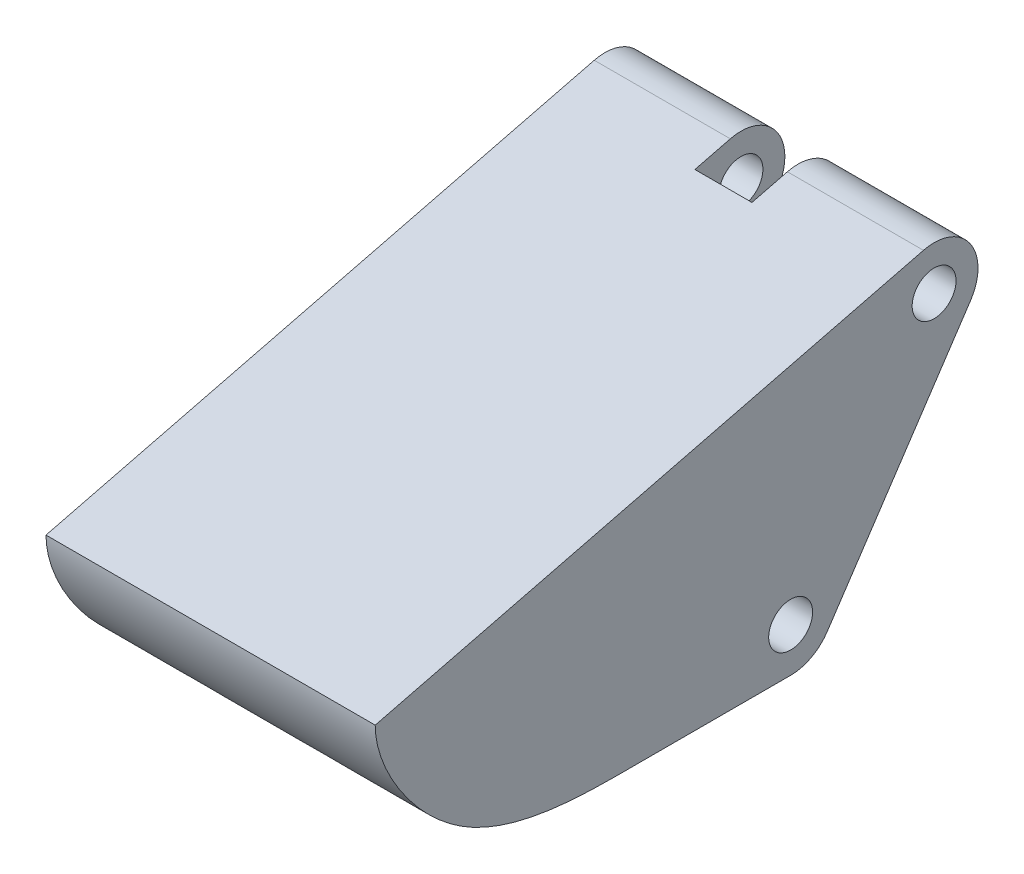
ISO-10303-21;
HEADER;
FILE_DESCRIPTION(('STEP AP214'),'2;1');
FILE_NAME('part.step','',(''),(''),'','','');
FILE_SCHEMA(('AUTOMOTIVE_DESIGN { 1 0 10303 214 1 1 1 1 }'));
ENDSEC;
DATA;
#1=APPLICATION_CONTEXT('core data for automotive mechanical design processes');
#2=APPLICATION_PROTOCOL_DEFINITION('international standard','automotive_design',2000,#1);
#3=PRODUCT_CONTEXT('',#1,'mechanical');
#4=PRODUCT('Part','Part','',(#3));
#5=PRODUCT_RELATED_PRODUCT_CATEGORY('part','',(#4));
#6=PRODUCT_DEFINITION_FORMATION('','',#4);
#7=PRODUCT_DEFINITION_CONTEXT('part definition',#1,'design');
#8=PRODUCT_DEFINITION('design','',#6,#7);
#9=PRODUCT_DEFINITION_SHAPE('','',#8);
#10=(LENGTH_UNIT() NAMED_UNIT(*) SI_UNIT(.MILLI.,.METRE.));
#11=(NAMED_UNIT(*) PLANE_ANGLE_UNIT() SI_UNIT($,.RADIAN.));
#12=(NAMED_UNIT(*) SI_UNIT($,.STERADIAN.) SOLID_ANGLE_UNIT());
#13=UNCERTAINTY_MEASURE_WITH_UNIT(LENGTH_MEASURE(1.E-05),#10,'distance_accuracy_value','');
#14=(GEOMETRIC_REPRESENTATION_CONTEXT(3) GLOBAL_UNCERTAINTY_ASSIGNED_CONTEXT((#13)) GLOBAL_UNIT_ASSIGNED_CONTEXT((#10,
#11,#12)) REPRESENTATION_CONTEXT('',''));
#15=CARTESIAN_POINT('',(0.,0.,0.));
#16=DIRECTION('',(0.,0.,1.));
#17=DIRECTION('',(1.,0.,0.));
#18=AXIS2_PLACEMENT_3D('',#15,#16,#17);
#19=CARTESIAN_POINT('',(7.5,-5.5,11.070367516976));
#20=DIRECTION('',(-1.,0.,0.));
#21=DIRECTION('',(0.,0.,1.));
#22=AXIS2_PLACEMENT_3D('',#19,#20,#21);
#23=CYLINDRICAL_SURFACE('',#22,2.);
#24=CARTESIAN_POINT('',(5.,-5.5,11.070367516976));
#25=DIRECTION('',(1.,0.,0.));
#26=DIRECTION('',(0.,0.,-1.));
#27=AXIS2_PLACEMENT_3D('',#24,#25,#26);
#28=CIRCLE('',#27,2.);
#29=CARTESIAN_POINT('',(5.,-6.60940039245046,9.4062669283003));
#30=VERTEX_POINT('',#29);
#31=CARTESIAN_POINT('',(5.,-7.5,11.070367516976));
#32=VERTEX_POINT('',#31);
#33=EDGE_CURVE('E122',#30,#32,#28,.F.);
#34=ORIENTED_EDGE('',*,*,#33,.F.);
#35=DIRECTION('',(-1.,0.,0.));
#36=VECTOR('',#35,1.);
#37=CARTESIAN_POINT('',(7.5,-6.60940039245046,9.4062669283003));
#38=LINE('',#37,#36);
#39=CARTESIAN_POINT('',(7.5,-6.60940039245046,9.4062669283003));
#40=VERTEX_POINT('',#39);
#41=EDGE_CURVE('E116',#40,#30,#38,.T.);
#42=ORIENTED_EDGE('',*,*,#41,.F.);
#43=CARTESIAN_POINT('',(7.5,-5.5,11.070367516976));
#44=DIRECTION('',(1.,0.,0.));
#45=DIRECTION('',(0.,0.,-1.));
#46=AXIS2_PLACEMENT_3D('',#43,#44,#45);
#47=CIRCLE('',#46,2.);
#48=CARTESIAN_POINT('',(7.5,-7.5,11.070367516976));
#49=VERTEX_POINT('',#48);
#50=EDGE_CURVE('E119',#40,#49,#47,.F.);
#51=ORIENTED_EDGE('',*,*,#50,.T.);
#52=DIRECTION('',(-1.,0.,0.));
#53=VECTOR('',#52,1.);
#54=CARTESIAN_POINT('',(7.5,-7.5,11.070367516976));
#55=LINE('',#54,#53);
#56=EDGE_CURVE('E176',#49,#32,#55,.T.);
#57=ORIENTED_EDGE('',*,*,#56,.T.);
#58=EDGE_LOOP('',(#34,#42,#51,#57));
#59=FACE_BOUND('',#58,.T.);
#60=ADVANCED_FACE('F43',(#59),#23,.T.);
#61=CARTESIAN_POINT('',(7.5,-5.5,11.070367516976));
#62=DIRECTION('',(-1.,0.,0.));
#63=DIRECTION('',(0.,0.,1.));
#64=AXIS2_PLACEMENT_3D('',#61,#62,#63);
#65=CYLINDRICAL_SURFACE('',#64,1.);
#66=CARTESIAN_POINT('',(5.,-5.5,11.070367516976));
#67=DIRECTION('',(1.,0.,0.));
#68=DIRECTION('',(0.,0.,-1.));
#69=AXIS2_PLACEMENT_3D('',#66,#67,#68);
#70=CIRCLE('',#69,1.);
#71=CARTESIAN_POINT('',(5.,-5.5,10.070367516976));
#72=VERTEX_POINT('',#71);
#73=EDGE_CURVE('E195',#72,#72,#70,.T.);
#74=ORIENTED_EDGE('',*,*,#73,.F.);
#75=EDGE_LOOP('',(#74));
#76=FACE_BOUND('',#75,.T.);
#77=CARTESIAN_POINT('',(7.5,-5.5,11.070367516976));
#78=DIRECTION('',(1.,0.,0.));
#79=DIRECTION('',(0.,0.,-1.));
#80=AXIS2_PLACEMENT_3D('',#77,#78,#79);
#81=CIRCLE('',#80,1.);
#82=CARTESIAN_POINT('',(7.5,-5.5,10.070367516976));
#83=VERTEX_POINT('',#82);
#84=EDGE_CURVE('E241',#83,#83,#81,.T.);
#85=ORIENTED_EDGE('',*,*,#84,.T.);
#86=EDGE_LOOP('',(#85));
#87=FACE_BOUND('',#86,.T.);
#88=ADVANCED_FACE('F265',(#76,#87),#65,.F.);
#89=CARTESIAN_POINT('',(7.5,4.3050263695366,4.53368327061825));
#90=DIRECTION('',(-1.,0.,0.));
#91=DIRECTION('',(0.,0.,1.));
#92=AXIS2_PLACEMENT_3D('',#89,#90,#91);
#93=CYLINDRICAL_SURFACE('',#92,1.);
#94=CARTESIAN_POINT('',(-1.3,4.3050263695366,4.53368327061825));
#95=DIRECTION('',(-1.,0.,0.));
#96=DIRECTION('',(0.,0.,1.));
#97=AXIS2_PLACEMENT_3D('',#94,#95,#96);
#98=CIRCLE('',#97,1.);
#99=CARTESIAN_POINT('',(-1.3,4.3050263695366,5.53368327061825));
#100=VERTEX_POINT('',#99);
#101=EDGE_CURVE('E234',#100,#100,#98,.T.);
#102=ORIENTED_EDGE('',*,*,#101,.F.);
#103=EDGE_LOOP('',(#102));
#104=FACE_BOUND('',#103,.T.);
#105=CARTESIAN_POINT('',(-7.5,4.3050263695366,4.53368327061825));
#106=DIRECTION('',(1.,0.,0.));
#107=DIRECTION('',(0.,0.,-1.));
#108=AXIS2_PLACEMENT_3D('',#105,#106,#107);
#109=CIRCLE('',#108,1.);
#110=CARTESIAN_POINT('',(-7.5,4.3050263695366,3.53368327061825));
#111=VERTEX_POINT('',#110);
#112=EDGE_CURVE('E143',#111,#111,#109,.T.);
#113=ORIENTED_EDGE('',*,*,#112,.F.);
#114=EDGE_LOOP('',(#113));
#115=FACE_BOUND('',#114,.T.);
#116=ADVANCED_FACE('F273',(#104,#115),#93,.F.);
#117=CARTESIAN_POINT('',(7.5,4.3050263695366,4.53368327061825));
#118=DIRECTION('',(-1.,0.,0.));
#119=DIRECTION('',(0.,0.,1.));
#120=AXIS2_PLACEMENT_3D('',#117,#118,#119);
#121=CYLINDRICAL_SURFACE('',#120,2.);
#122=CARTESIAN_POINT('',(-1.3,4.3050263695366,4.53368327061825));
#123=DIRECTION('',(-1.,0.,0.));
#124=DIRECTION('',(0.,0.,1.));
#125=AXIS2_PLACEMENT_3D('',#122,#123,#124);
#126=CIRCLE('',#125,2.);
#127=CARTESIAN_POINT('',(-1.3,6.24531136982727,5.01875452069092));
#128=VERTEX_POINT('',#127);
#129=CARTESIAN_POINT('',(-1.3,3.19562597708615,2.86958268194257));
#130=VERTEX_POINT('',#129);
#131=EDGE_CURVE('E186',#128,#130,#126,.T.);
#132=ORIENTED_EDGE('',*,*,#131,.T.);
#133=DIRECTION('',(-1.,0.,0.));
#134=VECTOR('',#133,1.);
#135=CARTESIAN_POINT('',(7.5,3.19562597708615,2.86958268194257));
#136=LINE('',#135,#134);
#137=CARTESIAN_POINT('',(-7.5,3.19562597708615,2.86958268194257));
#138=VERTEX_POINT('',#137);
#139=EDGE_CURVE('E174',#130,#138,#136,.T.);
#140=ORIENTED_EDGE('',*,*,#139,.T.);
#141=CARTESIAN_POINT('',(-7.5,4.3050263695366,4.53368327061825));
#142=DIRECTION('',(1.,0.,0.));
#143=DIRECTION('',(0.,0.,-1.));
#144=AXIS2_PLACEMENT_3D('',#141,#142,#143);
#145=CIRCLE('',#144,2.);
#146=CARTESIAN_POINT('',(-7.5,6.24531136982727,5.01875452069092));
#147=VERTEX_POINT('',#146);
#148=EDGE_CURVE('E168',#138,#147,#145,.T.);
#149=ORIENTED_EDGE('',*,*,#148,.T.);
#150=DIRECTION('',(-1.,0.,0.));
#151=VECTOR('',#150,1.);
#152=CARTESIAN_POINT('',(7.5,6.24531136982727,5.01875452069092));
#153=LINE('',#152,#151);
#154=EDGE_CURVE('E95',#128,#147,#153,.T.);
#155=ORIENTED_EDGE('',*,*,#154,.F.);
#156=EDGE_LOOP('',(#132,#140,#149,#155));
#157=FACE_BOUND('',#156,.T.);
#158=ADVANCED_FACE('F261',(#157),#121,.T.);
#159=CARTESIAN_POINT('',(7.5,7.05882352941176,1.76470588235294));
#160=DIRECTION('',(0.,-0.970142500145332,-0.242535625036333));
#161=DIRECTION('',(0.,0.242535625036333,-0.970142500145332));
#162=AXIS2_PLACEMENT_3D('',#159,#160,#161);
#163=PLANE('',#162);
#164=DIRECTION('',(-1.,0.,0.));
#165=VECTOR('',#164,1.);
#166=CARTESIAN_POINT('',(7.5,5.84157918234543,6.63368327061825));
#167=LINE('',#166,#165);
#168=CARTESIAN_POINT('',(1.3,5.84157918234543,6.63368327061825));
#169=VERTEX_POINT('',#168);
#170=CARTESIAN_POINT('',(-1.3,5.84157918234543,6.63368327061825));
#171=VERTEX_POINT('',#170);
#172=EDGE_CURVE('E147',#169,#171,#167,.T.);
#173=ORIENTED_EDGE('',*,*,#172,.T.);
#174=DIRECTION('',(0.,0.242535625036333,-0.970142500145332));
#175=VECTOR('',#174,1.);
#176=CARTESIAN_POINT('',(-1.3,7.05882352941176,1.76470588235294));
#177=LINE('',#176,#175);
#178=EDGE_CURVE('E229',#171,#128,#177,.T.);
#179=ORIENTED_EDGE('',*,*,#178,.T.);
#180=ORIENTED_EDGE('',*,*,#154,.T.);
#181=DIRECTION('',(0.,-0.242535625036333,0.970142500145332));
#182=VECTOR('',#181,1.);
#183=CARTESIAN_POINT('',(-7.5,7.05882352941176,1.76470588235294));
#184=LINE('',#183,#182);
#185=CARTESIAN_POINT('',(-7.5,0.,30.));
#186=VERTEX_POINT('',#185);
#187=EDGE_CURVE('E150',#147,#186,#184,.T.);
#188=ORIENTED_EDGE('',*,*,#187,.T.);
#189=DIRECTION('',(-1.,0.,0.));
#190=VECTOR('',#189,1.);
#191=CARTESIAN_POINT('',(7.5,0.,30.));
#192=LINE('',#191,#190);
#193=CARTESIAN_POINT('',(7.5,0.,30.));
#194=VERTEX_POINT('',#193);
#195=EDGE_CURVE('E181',#194,#186,#192,.T.);
#196=ORIENTED_EDGE('',*,*,#195,.F.);
#197=DIRECTION('',(0.,-0.242535625036333,0.970142500145332));
#198=VECTOR('',#197,1.);
#199=CARTESIAN_POINT('',(7.5,7.05882352941176,1.76470588235294));
#200=LINE('',#199,#198);
#201=CARTESIAN_POINT('',(7.5,6.24531136982727,5.01875452069092));
#202=VERTEX_POINT('',#201);
#203=EDGE_CURVE('E244',#202,#194,#200,.T.);
#204=ORIENTED_EDGE('',*,*,#203,.F.);
#205=CARTESIAN_POINT('',(1.3,6.24531136982727,5.01875452069092));
#206=VERTEX_POINT('',#205);
#207=EDGE_CURVE('E171',#202,#206,#153,.T.);
#208=ORIENTED_EDGE('',*,*,#207,.T.);
#209=DIRECTION('',(0.,-0.242535625036333,0.970142500145332));
#210=VECTOR('',#209,1.);
#211=CARTESIAN_POINT('',(1.3,7.05882352941176,1.76470588235294));
#212=LINE('',#211,#210);
#213=EDGE_CURVE('E223',#206,#169,#212,.T.);
#214=ORIENTED_EDGE('',*,*,#213,.T.);
#215=EDGE_LOOP('',(#173,#179,#180,#188,#196,#204,#208,#214));
#216=FACE_BOUND('',#215,.T.);
#217=ADVANCED_FACE('F258',(#216),#163,.F.);
#218=CARTESIAN_POINT('',(7.5,0.,30.));
#219=CARTESIAN_POINT('',(7.5,-1.86201061413692,30.));
#220=CARTESIAN_POINT('',(7.5,-7.67088107731904,26.2969055526664));
#221=CARTESIAN_POINT('',(7.5,-7.5,20.233591890825));
#222=CARTESIAN_POINT('',(7.5,-7.5,18.));
#223=B_SPLINE_CURVE_WITH_KNOTS('',3,(#218,#219,#220,#221,#222),.UNSPECIFIED.,.F.,.F.,(4,1,4),
(0.,0.469762972864334,1.),.UNSPECIFIED.);
#224=DIRECTION('',(-1.,0.,0.));
#225=VECTOR('',#224,1.);
#226=SURFACE_OF_LINEAR_EXTRUSION('',#223,#225);
#227=CARTESIAN_POINT('',(-7.5,0.,30.));
#228=CARTESIAN_POINT('',(-7.5,-1.86201061413692,30.));
#229=CARTESIAN_POINT('',(-7.5,-7.67088107731904,26.2969055526664));
#230=CARTESIAN_POINT('',(-7.5,-7.5,20.233591890825));
#231=CARTESIAN_POINT('',(-7.5,-7.5,18.));
#232=B_SPLINE_CURVE_WITH_KNOTS('',3,(#227,#228,#229,#230,#231),.UNSPECIFIED.,.F.,.F.,(4,1,4),
(0.,0.469762972864334,1.),.UNSPECIFIED.);
#233=CARTESIAN_POINT('',(-7.5,-7.5,18.));
#234=VERTEX_POINT('',#233);
#235=EDGE_CURVE('E152',#186,#234,#232,.T.);
#236=ORIENTED_EDGE('',*,*,#235,.T.);
#237=DIRECTION('',(-1.,0.,0.));
#238=VECTOR('',#237,1.);
#239=CARTESIAN_POINT('',(7.5,-7.5,18.));
#240=LINE('',#239,#238);
#241=CARTESIAN_POINT('',(7.5,-7.5,18.));
#242=VERTEX_POINT('',#241);
#243=EDGE_CURVE('E178',#242,#234,#240,.T.);
#244=ORIENTED_EDGE('',*,*,#243,.F.);
#245=EDGE_CURVE('E104',#194,#242,#223,.T.);
#246=ORIENTED_EDGE('',*,*,#245,.F.);
#247=ORIENTED_EDGE('',*,*,#195,.T.);
#248=EDGE_LOOP('',(#236,#244,#246,#247));
#249=FACE_BOUND('',#248,.T.);
#250=ADVANCED_FACE('F253',(#249),#226,.F.);
#251=CARTESIAN_POINT('',(7.5,-7.5,0.));
#252=DIRECTION('',(0.,1.,0.));
#253=DIRECTION('',(0.,0.,1.));
#254=AXIS2_PLACEMENT_3D('',#251,#252,#253);
#255=PLANE('',#254);
#256=CARTESIAN_POINT('',(0.,-7.5,10.7537427266206));
#257=DIRECTION('',(0.,-1.,0.));
#258=DIRECTION('',(0.,0.,1.));
#259=AXIS2_PLACEMENT_3D('',#256,#257,#258);
#260=CIRCLE('',#259,6.);
#261=CARTESIAN_POINT('',(5.,-7.5,14.070367516976));
#262=VERTEX_POINT('',#261);
#263=CARTESIAN_POINT('',(-5.,-7.5,14.070367516976));
#264=VERTEX_POINT('',#263);
#265=EDGE_CURVE('E336',#262,#264,#260,.T.);
#266=ORIENTED_EDGE('',*,*,#265,.F.);
#267=DIRECTION('',(0.,0.,1.));
#268=VECTOR('',#267,1.);
#269=CARTESIAN_POINT('',(5.,-7.5,7.07036751697599));
#270=LINE('',#269,#268);
#271=EDGE_CURVE('E330',#32,#262,#270,.T.);
#272=ORIENTED_EDGE('',*,*,#271,.F.);
#273=ORIENTED_EDGE('',*,*,#56,.F.);
#274=DIRECTION('',(0.,0.,-1.));
#275=VECTOR('',#274,1.);
#276=CARTESIAN_POINT('',(7.5,-7.5,0.));
#277=LINE('',#276,#275);
#278=EDGE_CURVE('E132',#242,#49,#277,.T.);
#279=ORIENTED_EDGE('',*,*,#278,.F.);
#280=ORIENTED_EDGE('',*,*,#243,.T.);
#281=DIRECTION('',(0.,0.,-1.));
#282=VECTOR('',#281,1.);
#283=CARTESIAN_POINT('',(-7.5,-7.5,0.));
#284=LINE('',#283,#282);
#285=CARTESIAN_POINT('',(-7.5,-7.5,11.070367516976));
#286=VERTEX_POINT('',#285);
#287=EDGE_CURVE('E156',#234,#286,#284,.T.);
#288=ORIENTED_EDGE('',*,*,#287,.T.);
#289=CARTESIAN_POINT('',(-5.,-7.5,11.070367516976));
#290=VERTEX_POINT('',#289);
#291=EDGE_CURVE('E126',#290,#286,#55,.T.);
#292=ORIENTED_EDGE('',*,*,#291,.F.);
#293=DIRECTION('',(0.,0.,-1.));
#294=VECTOR('',#293,1.);
#295=CARTESIAN_POINT('',(-5.,-7.5,7.07036751697599));
#296=LINE('',#295,#294);
#297=EDGE_CURVE('E299',#264,#290,#296,.T.);
#298=ORIENTED_EDGE('',*,*,#297,.F.);
#299=EDGE_LOOP('',(#266,#272,#273,#279,#280,#288,#292,#298));
#300=FACE_BOUND('',#299,.T.);
#301=ADVANCED_FACE('F257',(#300),#255,.F.);
#302=CARTESIAN_POINT('',(-5.,-5.5,11.070367516976));
#303=DIRECTION('',(-1.,0.,0.));
#304=DIRECTION('',(0.,0.,1.));
#305=AXIS2_PLACEMENT_3D('',#302,#303,#304);
#306=CIRCLE('',#305,2.);
#307=CARTESIAN_POINT('',(-5.,-6.60940039245046,9.4062669283003));
#308=VERTEX_POINT('',#307);
#309=EDGE_CURVE('E198',#290,#308,#306,.F.);
#310=ORIENTED_EDGE('',*,*,#309,.F.);
#311=ORIENTED_EDGE('',*,*,#291,.T.);
#312=CARTESIAN_POINT('',(-7.5,-5.5,11.070367516976));
#313=DIRECTION('',(1.,0.,0.));
#314=DIRECTION('',(0.,0.,-1.));
#315=AXIS2_PLACEMENT_3D('',#312,#313,#314);
#316=CIRCLE('',#315,2.);
#317=CARTESIAN_POINT('',(-7.5,-6.60940039245046,9.4062669283003));
#318=VERTEX_POINT('',#317);
#319=EDGE_CURVE('E162',#318,#286,#316,.F.);
#320=ORIENTED_EDGE('',*,*,#319,.F.);
#321=EDGE_CURVE('E127',#308,#318,#38,.T.);
#322=ORIENTED_EDGE('',*,*,#321,.F.);
#323=EDGE_LOOP('',(#310,#311,#320,#322));
#324=FACE_BOUND('',#323,.T.);
#325=ADVANCED_FACE('F274',(#324),#23,.T.);
#326=CARTESIAN_POINT('',(7.5,2.30769230769231,3.46153846153846));
#327=DIRECTION('',(0.,-0.554700196225229,-0.832050294337844));
#328=DIRECTION('',(0.,0.832050294337844,-0.554700196225229));
#329=AXIS2_PLACEMENT_3D('',#326,#327,#328);
#330=PLANE('',#329);
#331=DIRECTION('',(0.,-0.832050294337844,0.554700196225229));
#332=VECTOR('',#331,1.);
#333=CARTESIAN_POINT('',(5.,2.30769230769231,3.46153846153846));
#334=LINE('',#333,#332);
#335=CARTESIAN_POINT('',(5.,-3.5,7.33333333333333));
#336=VERTEX_POINT('',#335);
#337=EDGE_CURVE('E197',#336,#30,#334,.T.);
#338=ORIENTED_EDGE('',*,*,#337,.F.);
#339=DIRECTION('',(1.,0.,0.));
#340=VECTOR('',#339,1.);
#341=CARTESIAN_POINT('',(7.5,-3.5,7.33333333333333));
#342=LINE('',#341,#340);
#343=CARTESIAN_POINT('',(-5.,-3.5,7.33333333333333));
#344=VERTEX_POINT('',#343);
#345=EDGE_CURVE('E11',#344,#336,#342,.T.);
#346=ORIENTED_EDGE('',*,*,#345,.F.);
#347=DIRECTION('',(0.,0.832050294337844,-0.554700196225229));
#348=VECTOR('',#347,1.);
#349=CARTESIAN_POINT('',(-5.,2.30769230769231,3.46153846153846));
#350=LINE('',#349,#348);
#351=EDGE_CURVE('E193',#308,#344,#350,.T.);
#352=ORIENTED_EDGE('',*,*,#351,.F.);
#353=ORIENTED_EDGE('',*,*,#321,.T.);
#354=DIRECTION('',(0.,-0.832050294337844,0.554700196225229));
#355=VECTOR('',#354,1.);
#356=CARTESIAN_POINT('',(-7.5,2.30769230769231,3.46153846153846));
#357=LINE('',#356,#355);
#358=EDGE_CURVE('E165',#138,#318,#357,.T.);
#359=ORIENTED_EDGE('',*,*,#358,.F.);
#360=ORIENTED_EDGE('',*,*,#139,.F.);
#361=DIRECTION('',(0.,0.832050294337844,-0.554700196225229));
#362=VECTOR('',#361,1.);
#363=CARTESIAN_POINT('',(-1.3,2.30769230769231,3.46153846153846));
#364=LINE('',#363,#362);
#365=CARTESIAN_POINT('',(-1.3,-2.45052490592739,6.63368327061825));
#366=VERTEX_POINT('',#365);
#367=EDGE_CURVE('E231',#366,#130,#364,.T.);
#368=ORIENTED_EDGE('',*,*,#367,.F.);
#369=DIRECTION('',(-1.,0.,0.));
#370=VECTOR('',#369,1.);
#371=CARTESIAN_POINT('',(7.5,-2.45052490592739,6.63368327061825));
#372=LINE('',#371,#370);
#373=CARTESIAN_POINT('',(1.3,-2.45052490592739,6.63368327061825));
#374=VERTEX_POINT('',#373);
#375=EDGE_CURVE('E51',#374,#366,#372,.T.);
#376=ORIENTED_EDGE('',*,*,#375,.F.);
#377=DIRECTION('',(0.,-0.832050294337844,0.554700196225229));
#378=VECTOR('',#377,1.);
#379=CARTESIAN_POINT('',(1.3,2.30769230769231,3.46153846153846));
#380=LINE('',#379,#378);
#381=CARTESIAN_POINT('',(1.3,3.19562597708615,2.86958268194257));
#382=VERTEX_POINT('',#381);
#383=EDGE_CURVE('E218',#382,#374,#380,.T.);
#384=ORIENTED_EDGE('',*,*,#383,.F.);
#385=CARTESIAN_POINT('',(7.5,3.19562597708615,2.86958268194257));
#386=VERTEX_POINT('',#385);
#387=EDGE_CURVE('E138',#386,#382,#136,.T.);
#388=ORIENTED_EDGE('',*,*,#387,.F.);
#389=DIRECTION('',(0.,-0.832050294337844,0.554700196225229));
#390=VECTOR('',#389,1.);
#391=CARTESIAN_POINT('',(7.5,2.30769230769231,3.46153846153846));
#392=LINE('',#391,#390);
#393=EDGE_CURVE('E130',#386,#40,#392,.T.);
#394=ORIENTED_EDGE('',*,*,#393,.T.);
#395=ORIENTED_EDGE('',*,*,#41,.T.);
#396=EDGE_LOOP('',(#338,#346,#352,#353,#359,#360,#368,#376,#384,#388,#394,#395));
#397=FACE_BOUND('',#396,.T.);
#398=ADVANCED_FACE('F135',(#397),#330,.T.);
#399=CARTESIAN_POINT('',(-5.,-5.5,11.070367516976));
#400=DIRECTION('',(-1.,0.,0.));
#401=DIRECTION('',(0.,0.,1.));
#402=AXIS2_PLACEMENT_3D('',#399,#400,#401);
#403=CIRCLE('',#402,1.);
#404=CARTESIAN_POINT('',(-5.,-5.5,12.070367516976));
#405=VERTEX_POINT('',#404);
#406=EDGE_CURVE('E191',#405,#405,#403,.T.);
#407=ORIENTED_EDGE('',*,*,#406,.F.);
#408=EDGE_LOOP('',(#407));
#409=FACE_BOUND('',#408,.T.);
#410=CARTESIAN_POINT('',(-7.5,-5.5,11.070367516976));
#411=DIRECTION('',(1.,0.,0.));
#412=DIRECTION('',(0.,0.,-1.));
#413=AXIS2_PLACEMENT_3D('',#410,#411,#412);
#414=CIRCLE('',#413,1.);
#415=CARTESIAN_POINT('',(-7.5,-5.5,10.070367516976));
#416=VERTEX_POINT('',#415);
#417=EDGE_CURVE('E146',#416,#416,#414,.T.);
#418=ORIENTED_EDGE('',*,*,#417,.F.);
#419=EDGE_LOOP('',(#418));
#420=FACE_BOUND('',#419,.T.);
#421=ADVANCED_FACE('F262',(#409,#420),#65,.F.);
#422=CARTESIAN_POINT('',(1.3,4.3050263695366,4.53368327061825));
#423=DIRECTION('',(1.,0.,0.));
#424=DIRECTION('',(0.,0.,-1.));
#425=AXIS2_PLACEMENT_3D('',#422,#423,#424);
#426=CIRCLE('',#425,1.);
#427=CARTESIAN_POINT('',(1.3,4.3050263695366,3.53368327061825));
#428=VERTEX_POINT('',#427);
#429=EDGE_CURVE('E226',#428,#428,#426,.T.);
#430=ORIENTED_EDGE('',*,*,#429,.F.);
#431=EDGE_LOOP('',(#430));
#432=FACE_BOUND('',#431,.T.);
#433=CARTESIAN_POINT('',(7.5,4.3050263695366,4.53368327061825));
#434=DIRECTION('',(1.,0.,0.));
#435=DIRECTION('',(0.,0.,-1.));
#436=AXIS2_PLACEMENT_3D('',#433,#434,#435);
#437=CIRCLE('',#436,1.);
#438=CARTESIAN_POINT('',(7.5,4.3050263695366,3.53368327061825));
#439=VERTEX_POINT('',#438);
#440=EDGE_CURVE('E170',#439,#439,#437,.T.);
#441=ORIENTED_EDGE('',*,*,#440,.T.);
#442=EDGE_LOOP('',(#441));
#443=FACE_BOUND('',#442,.T.);
#444=ADVANCED_FACE('F45',(#432,#443),#93,.F.);
#445=ORIENTED_EDGE('',*,*,#387,.T.);
#446=CARTESIAN_POINT('',(1.3,4.3050263695366,4.53368327061825));
#447=DIRECTION('',(1.,0.,0.));
#448=DIRECTION('',(0.,0.,-1.));
#449=AXIS2_PLACEMENT_3D('',#446,#447,#448);
#450=CIRCLE('',#449,2.);
#451=EDGE_CURVE('E183',#382,#206,#450,.T.);
#452=ORIENTED_EDGE('',*,*,#451,.T.);
#453=ORIENTED_EDGE('',*,*,#207,.F.);
#454=CARTESIAN_POINT('',(7.5,4.3050263695366,4.53368327061825));
#455=DIRECTION('',(1.,0.,0.));
#456=DIRECTION('',(0.,0.,-1.));
#457=AXIS2_PLACEMENT_3D('',#454,#455,#456);
#458=CIRCLE('',#457,2.);
#459=EDGE_CURVE('E66',#386,#202,#458,.T.);
#460=ORIENTED_EDGE('',*,*,#459,.F.);
#461=EDGE_LOOP('',(#445,#452,#453,#460));
#462=FACE_BOUND('',#461,.T.);
#463=ADVANCED_FACE('F271',(#462),#121,.T.);
#464=CARTESIAN_POINT('',(7.5,0.,0.));
#465=DIRECTION('',(1.,0.,0.));
#466=DIRECTION('',(0.,0.,-1.));
#467=AXIS2_PLACEMENT_3D('',#464,#465,#466);
#468=PLANE('',#467);
#469=ORIENTED_EDGE('',*,*,#440,.F.);
#470=EDGE_LOOP('',(#469));
#471=FACE_BOUND('',#470,.T.);
#472=ORIENTED_EDGE('',*,*,#84,.F.);
#473=EDGE_LOOP('',(#472));
#474=FACE_BOUND('',#473,.T.);
#475=ORIENTED_EDGE('',*,*,#203,.T.);
#476=ORIENTED_EDGE('',*,*,#245,.T.);
#477=ORIENTED_EDGE('',*,*,#278,.T.);
#478=ORIENTED_EDGE('',*,*,#50,.F.);
#479=ORIENTED_EDGE('',*,*,#393,.F.);
#480=ORIENTED_EDGE('',*,*,#459,.T.);
#481=EDGE_LOOP('',(#475,#476,#477,#478,#479,#480));
#482=FACE_BOUND('',#481,.T.);
#483=ADVANCED_FACE('F129',(#471,#474,#482),#468,.T.);
#484=CARTESIAN_POINT('',(-7.5,0.,0.));
#485=DIRECTION('',(1.,0.,0.));
#486=DIRECTION('',(0.,0.,-1.));
#487=AXIS2_PLACEMENT_3D('',#484,#485,#486);
#488=PLANE('',#487);
#489=ORIENTED_EDGE('',*,*,#112,.T.);
#490=EDGE_LOOP('',(#489));
#491=FACE_BOUND('',#490,.T.);
#492=ORIENTED_EDGE('',*,*,#417,.T.);
#493=EDGE_LOOP('',(#492));
#494=FACE_BOUND('',#493,.T.);
#495=ORIENTED_EDGE('',*,*,#187,.F.);
#496=ORIENTED_EDGE('',*,*,#148,.F.);
#497=ORIENTED_EDGE('',*,*,#358,.T.);
#498=ORIENTED_EDGE('',*,*,#319,.T.);
#499=ORIENTED_EDGE('',*,*,#287,.F.);
#500=ORIENTED_EDGE('',*,*,#235,.F.);
#501=EDGE_LOOP('',(#495,#496,#497,#498,#499,#500));
#502=FACE_BOUND('',#501,.T.);
#503=ADVANCED_FACE('F303',(#491,#494,#502),#488,.F.);
#504=CARTESIAN_POINT('',(1.3,-8.69497363046339,6.63368327061825));
#505=DIRECTION('',(0.,0.,1.));
#506=DIRECTION('',(1.,0.,0.));
#507=AXIS2_PLACEMENT_3D('',#504,#505,#506);
#508=PLANE('',#507);
#509=DIRECTION('',(0.,1.,0.));
#510=VECTOR('',#509,1.);
#511=CARTESIAN_POINT('',(1.3,-8.69497363046339,6.63368327061825));
#512=LINE('',#511,#510);
#513=EDGE_CURVE('E215',#374,#169,#512,.T.);
#514=ORIENTED_EDGE('',*,*,#513,.F.);
#515=ORIENTED_EDGE('',*,*,#375,.T.);
#516=DIRECTION('',(0.,1.,0.));
#517=VECTOR('',#516,1.);
#518=CARTESIAN_POINT('',(-1.3,-8.69497363046339,6.63368327061825));
#519=LINE('',#518,#517);
#520=EDGE_CURVE('E214',#366,#171,#519,.T.);
#521=ORIENTED_EDGE('',*,*,#520,.T.);
#522=ORIENTED_EDGE('',*,*,#172,.F.);
#523=EDGE_LOOP('',(#514,#515,#521,#522));
#524=FACE_BOUND('',#523,.T.);
#525=ADVANCED_FACE('F373',(#524),#508,.F.);
#526=CARTESIAN_POINT('',(-1.3,-8.69497363046339,6.63368327061825));
#527=DIRECTION('',(-1.,0.,0.));
#528=DIRECTION('',(0.,0.,1.));
#529=AXIS2_PLACEMENT_3D('',#526,#527,#528);
#530=PLANE('',#529);
#531=ORIENTED_EDGE('',*,*,#101,.T.);
#532=EDGE_LOOP('',(#531));
#533=FACE_BOUND('',#532,.T.);
#534=ORIENTED_EDGE('',*,*,#367,.T.);
#535=ORIENTED_EDGE('',*,*,#131,.F.);
#536=ORIENTED_EDGE('',*,*,#178,.F.);
#537=ORIENTED_EDGE('',*,*,#520,.F.);
#538=EDGE_LOOP('',(#534,#535,#536,#537));
#539=FACE_BOUND('',#538,.T.);
#540=ADVANCED_FACE('F369',(#533,#539),#530,.F.);
#541=CARTESIAN_POINT('',(1.3,-8.69497363046339,6.63368327061825));
#542=DIRECTION('',(1.,0.,0.));
#543=DIRECTION('',(0.,0.,-1.));
#544=AXIS2_PLACEMENT_3D('',#541,#542,#543);
#545=PLANE('',#544);
#546=ORIENTED_EDGE('',*,*,#429,.T.);
#547=EDGE_LOOP('',(#546));
#548=FACE_BOUND('',#547,.T.);
#549=ORIENTED_EDGE('',*,*,#451,.F.);
#550=ORIENTED_EDGE('',*,*,#383,.T.);
#551=ORIENTED_EDGE('',*,*,#513,.T.);
#552=ORIENTED_EDGE('',*,*,#213,.F.);
#553=EDGE_LOOP('',(#549,#550,#551,#552));
#554=FACE_BOUND('',#553,.T.);
#555=ADVANCED_FACE('F375',(#548,#554),#545,.F.);
#556=CARTESIAN_POINT('',(0.,-3.5,10.7537427266206));
#557=DIRECTION('',(0.,-1.,0.));
#558=DIRECTION('',(0.,0.,-1.));
#559=AXIS2_PLACEMENT_3D('',#556,#557,#558);
#560=CYLINDRICAL_SURFACE('',#559,6.);
#561=ORIENTED_EDGE('',*,*,#265,.T.);
#562=DIRECTION('',(0.,-1.,0.));
#563=VECTOR('',#562,1.);
#564=CARTESIAN_POINT('',(-5.,-3.5,14.070367516976));
#565=LINE('',#564,#563);
#566=CARTESIAN_POINT('',(-5.,-3.5,14.070367516976));
#567=VERTEX_POINT('',#566);
#568=EDGE_CURVE('E316',#567,#264,#565,.T.);
#569=ORIENTED_EDGE('',*,*,#568,.F.);
#570=CARTESIAN_POINT('',(0.,-3.5,10.7537427266206));
#571=DIRECTION('',(0.,-1.,0.));
#572=DIRECTION('',(0.,0.,1.));
#573=AXIS2_PLACEMENT_3D('',#570,#571,#572);
#574=CIRCLE('',#573,6.);
#575=CARTESIAN_POINT('',(5.,-3.5,14.070367516976));
#576=VERTEX_POINT('',#575);
#577=EDGE_CURVE('E321',#576,#567,#574,.T.);
#578=ORIENTED_EDGE('',*,*,#577,.F.);
#579=DIRECTION('',(0.,-1.,0.));
#580=VECTOR('',#579,1.);
#581=CARTESIAN_POINT('',(5.,-3.5,14.070367516976));
#582=LINE('',#581,#580);
#583=EDGE_CURVE('E194',#576,#262,#582,.T.);
#584=ORIENTED_EDGE('',*,*,#583,.T.);
#585=EDGE_LOOP('',(#561,#569,#578,#584));
#586=FACE_BOUND('',#585,.T.);
#587=ADVANCED_FACE('F339',(#586),#560,.F.);
#588=CARTESIAN_POINT('',(5.,-3.5,7.07036751697599));
#589=DIRECTION('',(1.,0.,0.));
#590=DIRECTION('',(0.,0.,-1.));
#591=AXIS2_PLACEMENT_3D('',#588,#589,#590);
#592=PLANE('',#591);
#593=ORIENTED_EDGE('',*,*,#33,.T.);
#594=ORIENTED_EDGE('',*,*,#271,.T.);
#595=ORIENTED_EDGE('',*,*,#583,.F.);
#596=DIRECTION('',(0.,0.,1.));
#597=VECTOR('',#596,1.);
#598=CARTESIAN_POINT('',(5.,-3.5,7.07036751697599));
#599=LINE('',#598,#597);
#600=EDGE_CURVE('E320',#336,#576,#599,.T.);
#601=ORIENTED_EDGE('',*,*,#600,.F.);
#602=ORIENTED_EDGE('',*,*,#337,.T.);
#603=EDGE_LOOP('',(#593,#594,#595,#601,#602));
#604=FACE_BOUND('',#603,.T.);
#605=ORIENTED_EDGE('',*,*,#73,.T.);
#606=EDGE_LOOP('',(#605));
#607=FACE_BOUND('',#606,.T.);
#608=ADVANCED_FACE('F345',(#604,#607),#592,.F.);
#609=CARTESIAN_POINT('',(-5.,-3.5,7.07036751697599));
#610=DIRECTION('',(-1.,0.,0.));
#611=DIRECTION('',(0.,0.,1.));
#612=AXIS2_PLACEMENT_3D('',#609,#610,#611);
#613=PLANE('',#612);
#614=ORIENTED_EDGE('',*,*,#309,.T.);
#615=ORIENTED_EDGE('',*,*,#351,.T.);
#616=DIRECTION('',(0.,0.,-1.));
#617=VECTOR('',#616,1.);
#618=CARTESIAN_POINT('',(-5.,-3.5,7.07036751697599));
#619=LINE('',#618,#617);
#620=EDGE_CURVE('E57',#567,#344,#619,.T.);
#621=ORIENTED_EDGE('',*,*,#620,.F.);
#622=ORIENTED_EDGE('',*,*,#568,.T.);
#623=ORIENTED_EDGE('',*,*,#297,.T.);
#624=EDGE_LOOP('',(#614,#615,#621,#622,#623));
#625=FACE_BOUND('',#624,.T.);
#626=ORIENTED_EDGE('',*,*,#406,.T.);
#627=EDGE_LOOP('',(#626));
#628=FACE_BOUND('',#627,.T.);
#629=ADVANCED_FACE('F311',(#625,#628),#613,.F.);
#630=CARTESIAN_POINT('',(0.,-3.5,10.7537427266206));
#631=DIRECTION('',(0.,1.,0.));
#632=DIRECTION('',(0.,0.,1.));
#633=AXIS2_PLACEMENT_3D('',#630,#631,#632);
#634=PLANE('',#633);
#635=ORIENTED_EDGE('',*,*,#345,.T.);
#636=ORIENTED_EDGE('',*,*,#600,.T.);
#637=ORIENTED_EDGE('',*,*,#577,.T.);
#638=ORIENTED_EDGE('',*,*,#620,.T.);
#639=EDGE_LOOP('',(#635,#636,#637,#638));
#640=FACE_BOUND('',#639,.T.);
#641=ADVANCED_FACE('F325',(#640),#634,.F.);
#642=CLOSED_SHELL('',(#60,#88,#116,#158,#217,#250,#301,#325,#398,#421,#444,#463,#483,#503,#525,
#540,#555,#587,#608,#629,#641));
#643=MANIFOLD_SOLID_BREP('B2',#642);
#644=ADVANCED_BREP_SHAPE_REPRESENTATION('',(#18,#643),#14);
#645=SHAPE_DEFINITION_REPRESENTATION(#9,#644);
ENDSEC;
END-ISO-10303-21;
